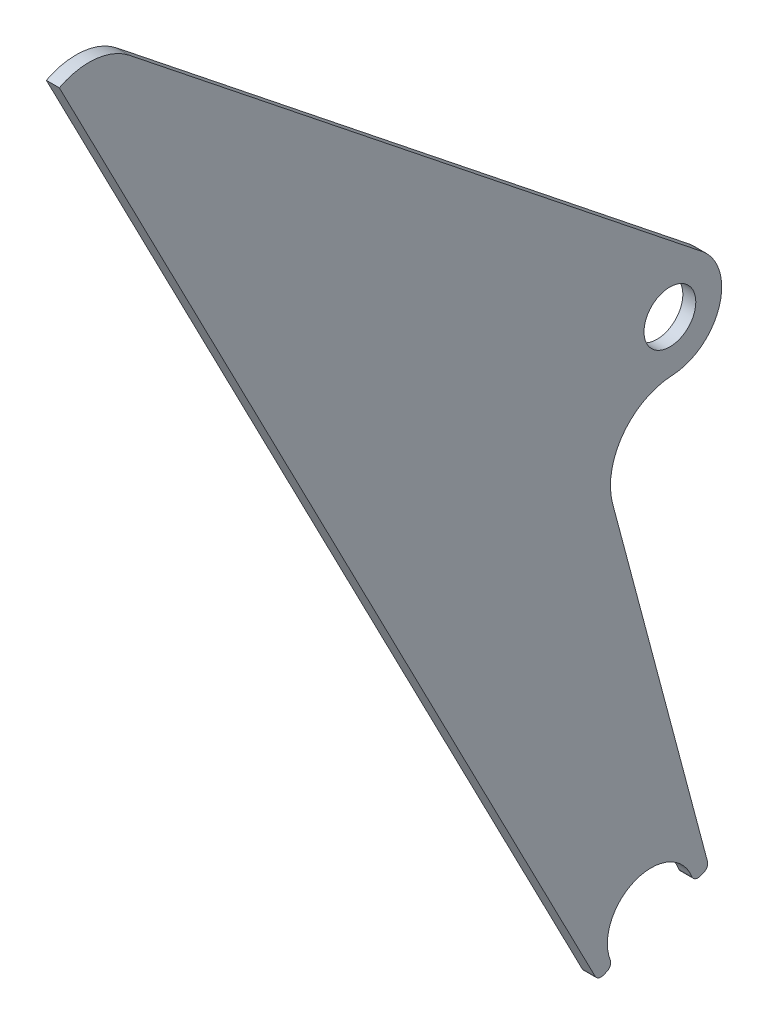
ISO-10303-21;
HEADER;
FILE_DESCRIPTION(('STEP AP214'),'2;1');
FILE_NAME('part.step','',(''),(''),'','','');
FILE_SCHEMA(('AUTOMOTIVE_DESIGN { 1 0 10303 214 1 1 1 1 }'));
ENDSEC;
DATA;
#1=APPLICATION_CONTEXT('core data for automotive mechanical design processes');
#2=APPLICATION_PROTOCOL_DEFINITION('international standard','automotive_design',2000,#1);
#3=PRODUCT_CONTEXT('',#1,'mechanical');
#4=PRODUCT('Part','Part','',(#3));
#5=PRODUCT_RELATED_PRODUCT_CATEGORY('part','',(#4));
#6=PRODUCT_DEFINITION_FORMATION('','',#4);
#7=PRODUCT_DEFINITION_CONTEXT('part definition',#1,'design');
#8=PRODUCT_DEFINITION('design','',#6,#7);
#9=PRODUCT_DEFINITION_SHAPE('','',#8);
#10=(LENGTH_UNIT() NAMED_UNIT(*) SI_UNIT(.MILLI.,.METRE.));
#11=(NAMED_UNIT(*) PLANE_ANGLE_UNIT() SI_UNIT($,.RADIAN.));
#12=(NAMED_UNIT(*) SI_UNIT($,.STERADIAN.) SOLID_ANGLE_UNIT());
#13=UNCERTAINTY_MEASURE_WITH_UNIT(LENGTH_MEASURE(1.E-05),#10,'distance_accuracy_value','');
#14=(GEOMETRIC_REPRESENTATION_CONTEXT(3) GLOBAL_UNCERTAINTY_ASSIGNED_CONTEXT((#13)) GLOBAL_UNIT_ASSIGNED_CONTEXT((#10,
#11,#12)) REPRESENTATION_CONTEXT('',''));
#15=CARTESIAN_POINT('',(0.,0.,0.));
#16=DIRECTION('',(0.,0.,1.));
#17=DIRECTION('',(1.,0.,0.));
#18=AXIS2_PLACEMENT_3D('',#15,#16,#17);
#19=CARTESIAN_POINT('',(4.,295.705040008935,173.559413238733));
#20=DIRECTION('',(1.,0.,0.));
#21=DIRECTION('',(0.,0.,-1.));
#22=AXIS2_PLACEMENT_3D('',#19,#20,#21);
#23=PLANE('',#22);
#24=CARTESIAN_POINT('',(4.,295.705040008935,173.559413238733));
#25=DIRECTION('',(1.,0.,0.));
#26=DIRECTION('',(0.,0.,-1.));
#27=AXIS2_PLACEMENT_3D('',#24,#25,#26);
#28=CIRCLE('',#27,20.);
#29=CARTESIAN_POINT('',(4.,311.348014413207,161.097577427454));
#30=VERTEX_POINT('',#29);
#31=CARTESIAN_POINT('',(4.,313.474626916136,182.737745393729));
#32=VERTEX_POINT('',#31);
#33=EDGE_CURVE('E186',#30,#32,#28,.T.);
#34=ORIENTED_EDGE('',*,*,#33,.T.);
#35=DIRECTION('',(0.,-0.888479345360042,-0.458916607749811));
#36=VECTOR('',#35,1.);
#37=CARTESIAN_POINT('',(4.,313.474626916136,182.737745393729));
#38=LINE('',#37,#36);
#39=CARTESIAN_POINT('',(4.,-6.89621979837412,17.260063820188));
#40=VERTEX_POINT('',#39);
#41=EDGE_CURVE('E109',#32,#40,#38,.T.);
#42=ORIENTED_EDGE('',*,*,#41,.T.);
#43=CARTESIAN_POINT('',(4.,-5.9783865828745,15.4831051294679));
#44=DIRECTION('',(1.,0.,0.));
#45=DIRECTION('',(0.,0.,-1.));
#46=AXIS2_PLACEMENT_3D('',#43,#44,#45);
#47=CIRCLE('',#46,2.);
#48=CARTESIAN_POINT('',(4.,-7.84436300859998,14.7632912794783));
#49=VERTEX_POINT('',#48);
#50=EDGE_CURVE('E216',#40,#49,#47,.T.);
#51=ORIENTED_EDGE('',*,*,#50,.T.);
#52=DIRECTION('',(0.,0.35990692499477,-0.932988212862741));
#53=VECTOR('',#52,1.);
#54=CARTESIAN_POINT('',(4.,-7.44946657384603,13.7395996154952));
#55=LINE('',#54,#53);
#56=CARTESIAN_POINT('',(4.,-7.44946657384603,13.7395996154952));
#57=VERTEX_POINT('',#56);
#58=EDGE_CURVE('E235',#49,#57,#55,.T.);
#59=ORIENTED_EDGE('',*,*,#58,.T.);
#60=CARTESIAN_POINT('',(4.,-5.58349014812054,14.4594134654847));
#61=DIRECTION('',(1.,0.,0.));
#62=DIRECTION('',(0.,0.,-1.));
#63=AXIS2_PLACEMENT_3D('',#60,#61,#62);
#64=CIRCLE('',#63,2.);
#65=CARTESIAN_POINT('',(4.,-4.86303980642757,12.5936826957448));
#66=VERTEX_POINT('',#65);
#67=EDGE_CURVE('E232',#57,#66,#64,.T.);
#68=ORIENTED_EDGE('',*,*,#67,.T.);
#69=CARTESIAN_POINT('',(4.,0.,0.));
#70=DIRECTION('',(-1.,0.,0.));
#71=DIRECTION('',(0.,0.,-1.));
#72=AXIS2_PLACEMENT_3D('',#69,#70,#71);
#73=CIRCLE('',#72,13.5);
#74=CARTESIAN_POINT('',(4.,4.8544466030332,-12.5969975858654));
#75=VERTEX_POINT('',#74);
#76=EDGE_CURVE('E234',#66,#75,#73,.T.);
#77=ORIENTED_EDGE('',*,*,#76,.T.);
#78=CARTESIAN_POINT('',(4.,5.57362387755663,-14.4632194504381));
#79=DIRECTION('',(1.,0.,0.));
#80=DIRECTION('',(0.,0.,-1.));
#81=AXIS2_PLACEMENT_3D('',#78,#79,#80);
#82=CIRCLE('',#81,2.);
#83=CARTESIAN_POINT('',(4.,3.70764745183115,-15.1830333004276));
#84=VERTEX_POINT('',#83);
#85=EDGE_CURVE('E237',#75,#84,#82,.T.);
#86=ORIENTED_EDGE('',*,*,#85,.T.);
#87=DIRECTION('',(0.,0.35990692499477,-0.932988212862741));
#88=VECTOR('',#87,1.);
#89=CARTESIAN_POINT('',(4.,4.10254388658508,-16.2067249644107));
#90=LINE('',#89,#88);
#91=CARTESIAN_POINT('',(4.,4.10254388658507,-16.2067249644107));
#92=VERTEX_POINT('',#91);
#93=EDGE_CURVE('E243',#84,#92,#90,.T.);
#94=ORIENTED_EDGE('',*,*,#93,.T.);
#95=CARTESIAN_POINT('',(4.,5.96852031231055,-15.4869111144212));
#96=DIRECTION('',(1.,0.,0.));
#97=DIRECTION('',(0.,0.,-1.));
#98=AXIS2_PLACEMENT_3D('',#95,#96,#97);
#99=CIRCLE('',#98,2.);
#100=CARTESIAN_POINT('',(4.,6.48183254164641,-17.4199166899988));
#101=VERTEX_POINT('',#100);
#102=EDGE_CURVE('E245',#92,#101,#99,.T.);
#103=ORIENTED_EDGE('',*,*,#102,.T.);
#104=DIRECTION('',(0.,0.966502787788823,0.256656114667926));
#105=VECTOR('',#104,1.);
#106=CARTESIAN_POINT('',(4.,116.832254223325,11.8837861431638));
#107=LINE('',#106,#105);
#108=CARTESIAN_POINT('',(4.,116.832254223325,11.8837861431638));
#109=VERTEX_POINT('',#108);
#110=EDGE_CURVE('E143',#101,#109,#107,.T.);
#111=ORIENTED_EDGE('',*,*,#110,.T.);
#112=CARTESIAN_POINT('',(4.,121.965376516684,-7.44626961261267));
#113=DIRECTION('',(-1.,0.,0.));
#114=DIRECTION('',(0.,0.,-1.));
#115=AXIS2_PLACEMENT_3D('',#112,#113,#114);
#116=CIRCLE('',#115,20.);
#117=CARTESIAN_POINT('',(4.,141.944645321849,-6.53587518658455));
#118=VERTEX_POINT('',#117);
#119=EDGE_CURVE('E137',#109,#118,#116,.T.);
#120=ORIENTED_EDGE('',*,*,#119,.T.);
#121=CARTESIAN_POINT('',(4.,157.928060365981,-5.80755964576205));
#122=DIRECTION('',(1.,0.,0.));
#123=DIRECTION('',(0.,0.,-1.));
#124=AXIS2_PLACEMENT_3D('',#121,#122,#123);
#125=CIRCLE('',#124,16.);
#126=CARTESIAN_POINT('',(4.,170.4424398894,-15.7770282947852));
#127=VERTEX_POINT('',#126);
#128=EDGE_CURVE('E141',#118,#127,#125,.T.);
#129=ORIENTED_EDGE('',*,*,#128,.T.);
#130=DIRECTION('',(0.,0.623091790563947,0.782148720213628));
#131=VECTOR('',#130,1.);
#132=CARTESIAN_POINT('',(4.,311.348014413207,161.097577427454));
#133=LINE('',#132,#131);
#134=EDGE_CURVE('E51',#127,#30,#133,.T.);
#135=ORIENTED_EDGE('',*,*,#134,.T.);
#136=EDGE_LOOP('',(#34,#42,#51,#59,#68,#77,#86,#94,#103,#111,#120,#129,#135));
#137=FACE_BOUND('',#136,.T.);
#138=CARTESIAN_POINT('',(4.,157.928060365981,-5.80755964576205));
#139=DIRECTION('',(1.,0.,0.));
#140=DIRECTION('',(0.,0.,-1.));
#141=AXIS2_PLACEMENT_3D('',#138,#139,#140);
#142=CIRCLE('',#141,8.00000000000001);
#143=CARTESIAN_POINT('',(4.,157.928060365981,-13.8075596457621));
#144=VERTEX_POINT('',#143);
#145=EDGE_CURVE('E165',#144,#144,#142,.T.);
#146=ORIENTED_EDGE('',*,*,#145,.F.);
#147=EDGE_LOOP('',(#146));
#148=FACE_BOUND('',#147,.T.);
#149=ADVANCED_FACE('F34',(#137,#148),#23,.T.);
#150=CARTESIAN_POINT('',(0.,295.705040008935,173.559413238733));
#151=DIRECTION('',(1.,0.,0.));
#152=DIRECTION('',(0.,0.,-1.));
#153=AXIS2_PLACEMENT_3D('',#150,#151,#152);
#154=PLANE('',#153);
#155=CARTESIAN_POINT('',(0.,295.705040008935,173.559413238733));
#156=DIRECTION('',(1.,0.,0.));
#157=DIRECTION('',(0.,0.,-1.));
#158=AXIS2_PLACEMENT_3D('',#155,#156,#157);
#159=CIRCLE('',#158,20.);
#160=CARTESIAN_POINT('',(0.,311.348014413207,161.097577427454));
#161=VERTEX_POINT('',#160);
#162=CARTESIAN_POINT('',(0.,313.474626916136,182.737745393729));
#163=VERTEX_POINT('',#162);
#164=EDGE_CURVE('E161',#161,#163,#159,.T.);
#165=ORIENTED_EDGE('',*,*,#164,.F.);
#166=DIRECTION('',(0.,0.623091790563947,0.782148720213628));
#167=VECTOR('',#166,1.);
#168=CARTESIAN_POINT('',(0.,311.348014413207,161.097577427454));
#169=LINE('',#168,#167);
#170=CARTESIAN_POINT('',(0.,170.4424398894,-15.7770282947852));
#171=VERTEX_POINT('',#170);
#172=EDGE_CURVE('E101',#171,#161,#169,.T.);
#173=ORIENTED_EDGE('',*,*,#172,.F.);
#174=CARTESIAN_POINT('',(0.,157.928060365981,-5.80755964576205));
#175=DIRECTION('',(1.,0.,0.));
#176=DIRECTION('',(0.,0.,-1.));
#177=AXIS2_PLACEMENT_3D('',#174,#175,#176);
#178=CIRCLE('',#177,16.);
#179=CARTESIAN_POINT('',(0.,141.944645321849,-6.53587518658455));
#180=VERTEX_POINT('',#179);
#181=EDGE_CURVE('E95',#180,#171,#178,.T.);
#182=ORIENTED_EDGE('',*,*,#181,.F.);
#183=CARTESIAN_POINT('',(0.,121.965376516684,-7.44626961261267));
#184=DIRECTION('',(-1.,0.,0.));
#185=DIRECTION('',(0.,0.,-1.));
#186=AXIS2_PLACEMENT_3D('',#183,#184,#185);
#187=CIRCLE('',#186,20.);
#188=CARTESIAN_POINT('',(0.,116.832254223325,11.8837861431638));
#189=VERTEX_POINT('',#188);
#190=EDGE_CURVE('E151',#189,#180,#187,.T.);
#191=ORIENTED_EDGE('',*,*,#190,.F.);
#192=DIRECTION('',(0.,0.966502787788823,0.256656114667926));
#193=VECTOR('',#192,1.);
#194=CARTESIAN_POINT('',(0.,116.832254223325,11.8837861431638));
#195=LINE('',#194,#193);
#196=CARTESIAN_POINT('',(0.,6.48183254164641,-17.4199166899988));
#197=VERTEX_POINT('',#196);
#198=EDGE_CURVE('E181',#197,#189,#195,.T.);
#199=ORIENTED_EDGE('',*,*,#198,.F.);
#200=CARTESIAN_POINT('',(0.,5.96852031231055,-15.4869111144212));
#201=DIRECTION('',(1.,0.,0.));
#202=DIRECTION('',(0.,0.,-1.));
#203=AXIS2_PLACEMENT_3D('',#200,#201,#202);
#204=CIRCLE('',#203,2.);
#205=CARTESIAN_POINT('',(0.,4.10254388658507,-16.2067249644107));
#206=VERTEX_POINT('',#205);
#207=EDGE_CURVE('E179',#206,#197,#204,.T.);
#208=ORIENTED_EDGE('',*,*,#207,.F.);
#209=DIRECTION('',(0.,0.35990692499477,-0.932988212862741));
#210=VECTOR('',#209,1.);
#211=CARTESIAN_POINT('',(0.,4.10254388658508,-16.2067249644107));
#212=LINE('',#211,#210);
#213=CARTESIAN_POINT('',(0.,3.70764745183115,-15.1830333004276));
#214=VERTEX_POINT('',#213);
#215=EDGE_CURVE('E177',#214,#206,#212,.T.);
#216=ORIENTED_EDGE('',*,*,#215,.F.);
#217=CARTESIAN_POINT('',(0.,5.57362387755663,-14.4632194504381));
#218=DIRECTION('',(1.,0.,0.));
#219=DIRECTION('',(0.,0.,-1.));
#220=AXIS2_PLACEMENT_3D('',#217,#218,#219);
#221=CIRCLE('',#220,2.);
#222=CARTESIAN_POINT('',(0.,4.8544466030332,-12.5969975858654));
#223=VERTEX_POINT('',#222);
#224=EDGE_CURVE('E175',#223,#214,#221,.T.);
#225=ORIENTED_EDGE('',*,*,#224,.F.);
#226=CARTESIAN_POINT('',(0.,0.,0.));
#227=DIRECTION('',(-1.,0.,0.));
#228=DIRECTION('',(0.,0.,-1.));
#229=AXIS2_PLACEMENT_3D('',#226,#227,#228);
#230=CIRCLE('',#229,13.5);
#231=CARTESIAN_POINT('',(0.,-4.86303980642757,12.5936826957448));
#232=VERTEX_POINT('',#231);
#233=EDGE_CURVE('E173',#232,#223,#230,.T.);
#234=ORIENTED_EDGE('',*,*,#233,.F.);
#235=CARTESIAN_POINT('',(0.,-5.58349014812054,14.4594134654847));
#236=DIRECTION('',(1.,0.,0.));
#237=DIRECTION('',(0.,0.,-1.));
#238=AXIS2_PLACEMENT_3D('',#235,#236,#237);
#239=CIRCLE('',#238,2.);
#240=CARTESIAN_POINT('',(0.,-7.44946657384603,13.7395996154952));
#241=VERTEX_POINT('',#240);
#242=EDGE_CURVE('E171',#241,#232,#239,.T.);
#243=ORIENTED_EDGE('',*,*,#242,.F.);
#244=DIRECTION('',(0.,0.35990692499477,-0.932988212862741));
#245=VECTOR('',#244,1.);
#246=CARTESIAN_POINT('',(0.,-7.44946657384603,13.7395996154952));
#247=LINE('',#246,#245);
#248=CARTESIAN_POINT('',(0.,-7.84436300859998,14.7632912794783));
#249=VERTEX_POINT('',#248);
#250=EDGE_CURVE('E169',#249,#241,#247,.T.);
#251=ORIENTED_EDGE('',*,*,#250,.F.);
#252=CARTESIAN_POINT('',(0.,-5.9783865828745,15.4831051294679));
#253=DIRECTION('',(1.,0.,0.));
#254=DIRECTION('',(0.,0.,-1.));
#255=AXIS2_PLACEMENT_3D('',#252,#253,#254);
#256=CIRCLE('',#255,2.);
#257=CARTESIAN_POINT('',(0.,-6.89621979837412,17.260063820188));
#258=VERTEX_POINT('',#257);
#259=EDGE_CURVE('E167',#258,#249,#256,.T.);
#260=ORIENTED_EDGE('',*,*,#259,.F.);
#261=DIRECTION('',(0.,-0.888479345360042,-0.458916607749811));
#262=VECTOR('',#261,1.);
#263=CARTESIAN_POINT('',(0.,313.474626916136,182.737745393729));
#264=LINE('',#263,#262);
#265=EDGE_CURVE('E164',#163,#258,#264,.T.);
#266=ORIENTED_EDGE('',*,*,#265,.F.);
#267=EDGE_LOOP('',(#165,#173,#182,#191,#199,#208,#216,#225,#234,#243,#251,#260,#266));
#268=FACE_BOUND('',#267,.T.);
#269=CARTESIAN_POINT('',(0.,157.928060365981,-5.80755964576205));
#270=DIRECTION('',(1.,0.,0.));
#271=DIRECTION('',(0.,0.,-1.));
#272=AXIS2_PLACEMENT_3D('',#269,#270,#271);
#273=CIRCLE('',#272,8.00000000000001);
#274=CARTESIAN_POINT('',(0.,157.928060365981,-13.8075596457621));
#275=VERTEX_POINT('',#274);
#276=EDGE_CURVE('E405',#275,#275,#273,.T.);
#277=ORIENTED_EDGE('',*,*,#276,.T.);
#278=EDGE_LOOP('',(#277));
#279=FACE_BOUND('',#278,.T.);
#280=ADVANCED_FACE('F220',(#268,#279),#154,.F.);
#281=CARTESIAN_POINT('',(4.,295.705040008935,173.559413238733));
#282=DIRECTION('',(-1.,0.,0.));
#283=DIRECTION('',(0.,0.,1.));
#284=AXIS2_PLACEMENT_3D('',#281,#282,#283);
#285=CYLINDRICAL_SURFACE('',#284,20.);
#286=ORIENTED_EDGE('',*,*,#164,.T.);
#287=DIRECTION('',(-1.,0.,0.));
#288=VECTOR('',#287,1.);
#289=CARTESIAN_POINT('',(4.,313.474626916136,182.737745393729));
#290=LINE('',#289,#288);
#291=EDGE_CURVE('E11',#32,#163,#290,.T.);
#292=ORIENTED_EDGE('',*,*,#291,.F.);
#293=ORIENTED_EDGE('',*,*,#33,.F.);
#294=DIRECTION('',(-1.,0.,0.));
#295=VECTOR('',#294,1.);
#296=CARTESIAN_POINT('',(4.,311.348014413207,161.097577427454));
#297=LINE('',#296,#295);
#298=EDGE_CURVE('E157',#30,#161,#297,.T.);
#299=ORIENTED_EDGE('',*,*,#298,.T.);
#300=EDGE_LOOP('',(#286,#292,#293,#299));
#301=FACE_BOUND('',#300,.T.);
#302=ADVANCED_FACE('F36',(#301),#285,.T.);
#303=CARTESIAN_POINT('',(4.,313.474626916136,182.737745393729));
#304=DIRECTION('',(0.,0.458916607749811,-0.888479345360041));
#305=DIRECTION('',(0.,0.888479345360042,0.458916607749811));
#306=AXIS2_PLACEMENT_3D('',#303,#304,#305);
#307=PLANE('',#306);
#308=ORIENTED_EDGE('',*,*,#265,.T.);
#309=DIRECTION('',(-1.,0.,0.));
#310=VECTOR('',#309,1.);
#311=CARTESIAN_POINT('',(4.,-6.89621979837412,17.260063820188));
#312=LINE('',#311,#310);
#313=EDGE_CURVE('E43',#40,#258,#312,.T.);
#314=ORIENTED_EDGE('',*,*,#313,.F.);
#315=ORIENTED_EDGE('',*,*,#41,.F.);
#316=ORIENTED_EDGE('',*,*,#291,.T.);
#317=EDGE_LOOP('',(#308,#314,#315,#316));
#318=FACE_BOUND('',#317,.T.);
#319=ADVANCED_FACE('F279',(#318),#307,.F.);
#320=CARTESIAN_POINT('',(4.,-5.9783865828745,15.4831051294679));
#321=DIRECTION('',(-1.,0.,0.));
#322=DIRECTION('',(0.,0.,1.));
#323=AXIS2_PLACEMENT_3D('',#320,#321,#322);
#324=CYLINDRICAL_SURFACE('',#323,2.);
#325=ORIENTED_EDGE('',*,*,#259,.T.);
#326=DIRECTION('',(-1.,0.,0.));
#327=VECTOR('',#326,1.);
#328=CARTESIAN_POINT('',(4.,-7.84436300859998,14.7632912794783));
#329=LINE('',#328,#327);
#330=EDGE_CURVE('E208',#49,#249,#329,.T.);
#331=ORIENTED_EDGE('',*,*,#330,.F.);
#332=ORIENTED_EDGE('',*,*,#50,.F.);
#333=ORIENTED_EDGE('',*,*,#313,.T.);
#334=EDGE_LOOP('',(#325,#331,#332,#333));
#335=FACE_BOUND('',#334,.T.);
#336=ADVANCED_FACE('F214',(#335),#324,.T.);
#337=CARTESIAN_POINT('',(4.,-7.44946657384603,13.7395996154952));
#338=DIRECTION('',(0.,0.932988212862741,0.35990692499477));
#339=DIRECTION('',(0.,-0.35990692499477,0.932988212862741));
#340=AXIS2_PLACEMENT_3D('',#337,#338,#339);
#341=PLANE('',#340);
#342=ORIENTED_EDGE('',*,*,#250,.T.);
#343=DIRECTION('',(-1.,0.,0.));
#344=VECTOR('',#343,1.);
#345=CARTESIAN_POINT('',(4.,-7.44946657384603,13.7395996154952));
#346=LINE('',#345,#344);
#347=EDGE_CURVE('E205',#57,#241,#346,.T.);
#348=ORIENTED_EDGE('',*,*,#347,.F.);
#349=ORIENTED_EDGE('',*,*,#58,.F.);
#350=ORIENTED_EDGE('',*,*,#330,.T.);
#351=EDGE_LOOP('',(#342,#348,#349,#350));
#352=FACE_BOUND('',#351,.T.);
#353=ADVANCED_FACE('F226',(#352),#341,.F.);
#354=CARTESIAN_POINT('',(4.,-5.58349014812054,14.4594134654847));
#355=DIRECTION('',(-1.,0.,0.));
#356=DIRECTION('',(0.,0.,1.));
#357=AXIS2_PLACEMENT_3D('',#354,#355,#356);
#358=CYLINDRICAL_SURFACE('',#357,2.);
#359=ORIENTED_EDGE('',*,*,#242,.T.);
#360=DIRECTION('',(-1.,0.,0.));
#361=VECTOR('',#360,1.);
#362=CARTESIAN_POINT('',(4.,-4.86303980642757,12.5936826957448));
#363=LINE('',#362,#361);
#364=EDGE_CURVE('E202',#66,#232,#363,.T.);
#365=ORIENTED_EDGE('',*,*,#364,.F.);
#366=ORIENTED_EDGE('',*,*,#67,.F.);
#367=ORIENTED_EDGE('',*,*,#347,.T.);
#368=EDGE_LOOP('',(#359,#365,#366,#367));
#369=FACE_BOUND('',#368,.T.);
#370=ADVANCED_FACE('F230',(#369),#358,.T.);
#371=CARTESIAN_POINT('',(4.,0.,0.));
#372=DIRECTION('',(-1.,0.,0.));
#373=DIRECTION('',(0.,0.,1.));
#374=AXIS2_PLACEMENT_3D('',#371,#372,#373);
#375=CYLINDRICAL_SURFACE('',#374,13.5);
#376=ORIENTED_EDGE('',*,*,#233,.T.);
#377=DIRECTION('',(-1.,0.,0.));
#378=VECTOR('',#377,1.);
#379=CARTESIAN_POINT('',(4.,4.8544466030332,-12.5969975858654));
#380=LINE('',#379,#378);
#381=EDGE_CURVE('E199',#75,#223,#380,.T.);
#382=ORIENTED_EDGE('',*,*,#381,.F.);
#383=ORIENTED_EDGE('',*,*,#76,.F.);
#384=ORIENTED_EDGE('',*,*,#364,.T.);
#385=EDGE_LOOP('',(#376,#382,#383,#384));
#386=FACE_BOUND('',#385,.T.);
#387=ADVANCED_FACE('F292',(#386),#375,.F.);
#388=CARTESIAN_POINT('',(4.,5.57362387755663,-14.4632194504381));
#389=DIRECTION('',(-1.,0.,0.));
#390=DIRECTION('',(0.,0.,1.));
#391=AXIS2_PLACEMENT_3D('',#388,#389,#390);
#392=CYLINDRICAL_SURFACE('',#391,2.);
#393=ORIENTED_EDGE('',*,*,#224,.T.);
#394=DIRECTION('',(-1.,0.,0.));
#395=VECTOR('',#394,1.);
#396=CARTESIAN_POINT('',(4.,3.70764745183115,-15.1830333004276));
#397=LINE('',#396,#395);
#398=EDGE_CURVE('E196',#84,#214,#397,.T.);
#399=ORIENTED_EDGE('',*,*,#398,.F.);
#400=ORIENTED_EDGE('',*,*,#85,.F.);
#401=ORIENTED_EDGE('',*,*,#381,.T.);
#402=EDGE_LOOP('',(#393,#399,#400,#401));
#403=FACE_BOUND('',#402,.T.);
#404=ADVANCED_FACE('F295',(#403),#392,.T.);
#405=CARTESIAN_POINT('',(4.,4.10254388658508,-16.2067249644107));
#406=DIRECTION('',(0.,0.932988212862742,0.35990692499477));
#407=DIRECTION('',(0.,-0.35990692499477,0.932988212862741));
#408=AXIS2_PLACEMENT_3D('',#405,#406,#407);
#409=PLANE('',#408);
#410=ORIENTED_EDGE('',*,*,#215,.T.);
#411=DIRECTION('',(-1.,0.,0.));
#412=VECTOR('',#411,1.);
#413=CARTESIAN_POINT('',(4.,4.10254388658507,-16.2067249644107));
#414=LINE('',#413,#412);
#415=EDGE_CURVE('E193',#92,#206,#414,.T.);
#416=ORIENTED_EDGE('',*,*,#415,.F.);
#417=ORIENTED_EDGE('',*,*,#93,.F.);
#418=ORIENTED_EDGE('',*,*,#398,.T.);
#419=EDGE_LOOP('',(#410,#416,#417,#418));
#420=FACE_BOUND('',#419,.T.);
#421=ADVANCED_FACE('F299',(#420),#409,.F.);
#422=CARTESIAN_POINT('',(4.,5.96852031231055,-15.4869111144212));
#423=DIRECTION('',(-1.,0.,0.));
#424=DIRECTION('',(0.,0.,1.));
#425=AXIS2_PLACEMENT_3D('',#422,#423,#424);
#426=CYLINDRICAL_SURFACE('',#425,2.);
#427=ORIENTED_EDGE('',*,*,#207,.T.);
#428=DIRECTION('',(-1.,0.,0.));
#429=VECTOR('',#428,1.);
#430=CARTESIAN_POINT('',(4.,6.48183254164641,-17.4199166899988));
#431=LINE('',#430,#429);
#432=EDGE_CURVE('E190',#101,#197,#431,.T.);
#433=ORIENTED_EDGE('',*,*,#432,.F.);
#434=ORIENTED_EDGE('',*,*,#102,.F.);
#435=ORIENTED_EDGE('',*,*,#415,.T.);
#436=EDGE_LOOP('',(#427,#433,#434,#435));
#437=FACE_BOUND('',#436,.T.);
#438=ADVANCED_FACE('F251',(#437),#426,.T.);
#439=CARTESIAN_POINT('',(4.,116.832254223325,11.8837861431638));
#440=DIRECTION('',(0.,-0.256656114667926,0.966502787788823));
#441=DIRECTION('',(0.,-0.966502787788823,-0.256656114667926));
#442=AXIS2_PLACEMENT_3D('',#439,#440,#441);
#443=PLANE('',#442);
#444=ORIENTED_EDGE('',*,*,#198,.T.);
#445=DIRECTION('',(-1.,0.,0.));
#446=VECTOR('',#445,1.);
#447=CARTESIAN_POINT('',(4.,116.832254223325,11.8837861431638));
#448=LINE('',#447,#446);
#449=EDGE_CURVE('E152',#109,#189,#448,.T.);
#450=ORIENTED_EDGE('',*,*,#449,.F.);
#451=ORIENTED_EDGE('',*,*,#110,.F.);
#452=ORIENTED_EDGE('',*,*,#432,.T.);
#453=EDGE_LOOP('',(#444,#450,#451,#452));
#454=FACE_BOUND('',#453,.T.);
#455=ADVANCED_FACE('F255',(#454),#443,.F.);
#456=CARTESIAN_POINT('',(4.,121.965376516684,-7.44626961261267));
#457=DIRECTION('',(-1.,0.,0.));
#458=DIRECTION('',(0.,0.,1.));
#459=AXIS2_PLACEMENT_3D('',#456,#457,#458);
#460=CYLINDRICAL_SURFACE('',#459,20.);
#461=ORIENTED_EDGE('',*,*,#190,.T.);
#462=DIRECTION('',(-1.,0.,0.));
#463=VECTOR('',#462,1.);
#464=CARTESIAN_POINT('',(4.,141.944645321849,-6.53587518658455));
#465=LINE('',#464,#463);
#466=EDGE_CURVE('E148',#118,#180,#465,.T.);
#467=ORIENTED_EDGE('',*,*,#466,.F.);
#468=ORIENTED_EDGE('',*,*,#119,.F.);
#469=ORIENTED_EDGE('',*,*,#449,.T.);
#470=EDGE_LOOP('',(#461,#467,#468,#469));
#471=FACE_BOUND('',#470,.T.);
#472=ADVANCED_FACE('F149',(#471),#460,.F.);
#473=CARTESIAN_POINT('',(4.,157.928060365981,-5.80755964576205));
#474=DIRECTION('',(-1.,0.,0.));
#475=DIRECTION('',(0.,0.,1.));
#476=AXIS2_PLACEMENT_3D('',#473,#474,#475);
#477=CYLINDRICAL_SURFACE('',#476,16.);
#478=ORIENTED_EDGE('',*,*,#181,.T.);
#479=DIRECTION('',(-1.,0.,0.));
#480=VECTOR('',#479,1.);
#481=CARTESIAN_POINT('',(4.,170.4424398894,-15.7770282947852));
#482=LINE('',#481,#480);
#483=EDGE_CURVE('E153',#127,#171,#482,.T.);
#484=ORIENTED_EDGE('',*,*,#483,.F.);
#485=ORIENTED_EDGE('',*,*,#128,.F.);
#486=ORIENTED_EDGE('',*,*,#466,.T.);
#487=EDGE_LOOP('',(#478,#484,#485,#486));
#488=FACE_BOUND('',#487,.T.);
#489=ADVANCED_FACE('F155',(#488),#477,.T.);
#490=CARTESIAN_POINT('',(4.,311.348014413207,161.097577427454));
#491=DIRECTION('',(0.,-0.782148720213628,0.623091790563947));
#492=DIRECTION('',(0.,-0.623091790563947,-0.782148720213628));
#493=AXIS2_PLACEMENT_3D('',#490,#491,#492);
#494=PLANE('',#493);
#495=ORIENTED_EDGE('',*,*,#172,.T.);
#496=ORIENTED_EDGE('',*,*,#298,.F.);
#497=ORIENTED_EDGE('',*,*,#134,.F.);
#498=ORIENTED_EDGE('',*,*,#483,.T.);
#499=EDGE_LOOP('',(#495,#496,#497,#498));
#500=FACE_BOUND('',#499,.T.);
#501=ADVANCED_FACE('F259',(#500),#494,.F.);
#502=CARTESIAN_POINT('',(4.,157.928060365981,-5.80755964576205));
#503=DIRECTION('',(-1.,0.,0.));
#504=DIRECTION('',(0.,0.,1.));
#505=AXIS2_PLACEMENT_3D('',#502,#503,#504);
#506=CYLINDRICAL_SURFACE('',#505,8.00000000000001);
#507=ORIENTED_EDGE('',*,*,#145,.T.);
#508=EDGE_LOOP('',(#507));
#509=FACE_BOUND('',#508,.T.);
#510=ORIENTED_EDGE('',*,*,#276,.F.);
#511=EDGE_LOOP('',(#510));
#512=FACE_BOUND('',#511,.T.);
#513=ADVANCED_FACE('F261',(#509,#512),#506,.F.);
#514=CLOSED_SHELL('',(#149,#280,#302,#319,#336,#353,#370,#387,#404,#421,#438,#455,#472,#489,
#501,#513));
#515=MANIFOLD_SOLID_BREP('B2',#514);
#516=ADVANCED_BREP_SHAPE_REPRESENTATION('',(#18,#515),#14);
#517=SHAPE_DEFINITION_REPRESENTATION(#9,#516);
ENDSEC;
END-ISO-10303-21;
